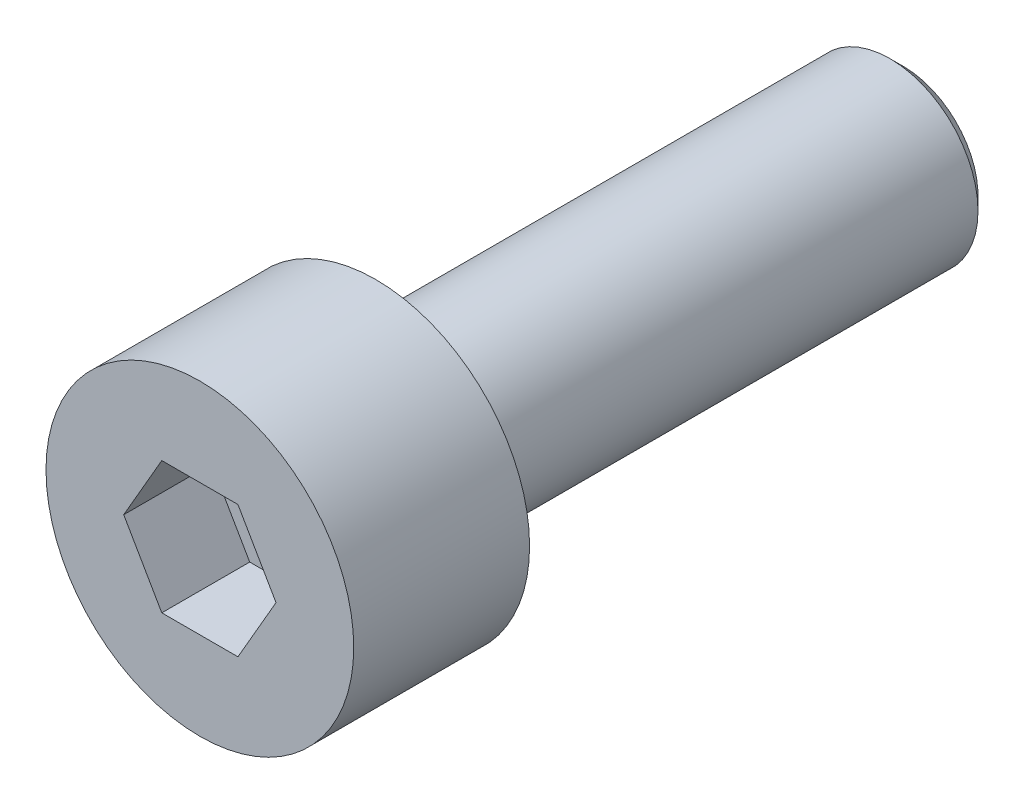
ISO-10303-21;
HEADER;
FILE_DESCRIPTION(('STEP AP214'),'2;1');
FILE_NAME('part.step','',(''),(''),'','','');
FILE_SCHEMA(('AUTOMOTIVE_DESIGN { 1 0 10303 214 1 1 1 1 }'));
ENDSEC;
DATA;
#1=APPLICATION_CONTEXT('core data for automotive mechanical design processes');
#2=APPLICATION_PROTOCOL_DEFINITION('international standard','automotive_design',2000,#1);
#3=PRODUCT_CONTEXT('',#1,'mechanical');
#4=PRODUCT('Part','Part','',(#3));
#5=PRODUCT_RELATED_PRODUCT_CATEGORY('part','',(#4));
#6=PRODUCT_DEFINITION_FORMATION('','',#4);
#7=PRODUCT_DEFINITION_CONTEXT('part definition',#1,'design');
#8=PRODUCT_DEFINITION('design','',#6,#7);
#9=PRODUCT_DEFINITION_SHAPE('','',#8);
#10=(LENGTH_UNIT() NAMED_UNIT(*) SI_UNIT(.MILLI.,.METRE.));
#11=(NAMED_UNIT(*) PLANE_ANGLE_UNIT() SI_UNIT($,.RADIAN.));
#12=(NAMED_UNIT(*) SI_UNIT($,.STERADIAN.) SOLID_ANGLE_UNIT());
#13=UNCERTAINTY_MEASURE_WITH_UNIT(LENGTH_MEASURE(1.E-05),#10,'distance_accuracy_value','');
#14=(GEOMETRIC_REPRESENTATION_CONTEXT(3) GLOBAL_UNCERTAINTY_ASSIGNED_CONTEXT((#13)) GLOBAL_UNIT_ASSIGNED_CONTEXT((#10,
#11,#12)) REPRESENTATION_CONTEXT('',''));
#15=CARTESIAN_POINT('',(0.,0.,0.));
#16=DIRECTION('',(0.,0.,1.));
#17=DIRECTION('',(1.,0.,0.));
#18=AXIS2_PLACEMENT_3D('',#15,#16,#17);
#19=CARTESIAN_POINT('',(0.,0.,0.));
#20=DIRECTION('',(0.,0.,1.));
#21=DIRECTION('',(1.,0.,0.));
#22=AXIS2_PLACEMENT_3D('',#19,#20,#21);
#23=PLANE('',#22);
#24=DIRECTION('',(0.5,0.866025403784439,0.));
#25=VECTOR('',#24,1.);
#26=CARTESIAN_POINT('',(0.86602540378444,-1.5,0.));
#27=LINE('',#26,#25);
#28=CARTESIAN_POINT('',(0.86602540378444,-1.5,0.));
#29=VERTEX_POINT('',#28);
#30=CARTESIAN_POINT('',(1.73205080756888,0.,0.));
#31=VERTEX_POINT('',#30);
#32=EDGE_CURVE('E50',#29,#31,#27,.T.);
#33=ORIENTED_EDGE('',*,*,#32,.F.);
#34=DIRECTION('',(1.,0.,0.));
#35=VECTOR('',#34,1.);
#36=CARTESIAN_POINT('',(-0.866025403784438,-1.5,0.));
#37=LINE('',#36,#35);
#38=CARTESIAN_POINT('',(-0.866025403784438,-1.5,0.));
#39=VERTEX_POINT('',#38);
#40=EDGE_CURVE('E133',#39,#29,#37,.T.);
#41=ORIENTED_EDGE('',*,*,#40,.F.);
#42=DIRECTION('',(0.5,-0.866025403784438,0.));
#43=VECTOR('',#42,1.);
#44=CARTESIAN_POINT('',(-1.73205080756888,0.,0.));
#45=LINE('',#44,#43);
#46=CARTESIAN_POINT('',(-1.73205080756888,0.,0.));
#47=VERTEX_POINT('',#46);
#48=EDGE_CURVE('E131',#47,#39,#45,.T.);
#49=ORIENTED_EDGE('',*,*,#48,.F.);
#50=DIRECTION('',(-0.5,-0.866025403784439,0.));
#51=VECTOR('',#50,1.);
#52=CARTESIAN_POINT('',(-0.866025403784438,1.5,0.));
#53=LINE('',#52,#51);
#54=CARTESIAN_POINT('',(-0.866025403784438,1.5,0.));
#55=VERTEX_POINT('',#54);
#56=EDGE_CURVE('E98',#55,#47,#53,.T.);
#57=ORIENTED_EDGE('',*,*,#56,.F.);
#58=DIRECTION('',(-1.,0.,0.));
#59=VECTOR('',#58,1.);
#60=CARTESIAN_POINT('',(0.866025403784438,1.5,0.));
#61=LINE('',#60,#59);
#62=CARTESIAN_POINT('',(0.866025403784438,1.5,0.));
#63=VERTEX_POINT('',#62);
#64=EDGE_CURVE('E127',#63,#55,#61,.T.);
#65=ORIENTED_EDGE('',*,*,#64,.F.);
#66=DIRECTION('',(-0.5,0.866025403784438,0.));
#67=VECTOR('',#66,1.);
#68=CARTESIAN_POINT('',(1.73205080756888,0.,0.));
#69=LINE('',#68,#67);
#70=EDGE_CURVE('E124',#31,#63,#69,.T.);
#71=ORIENTED_EDGE('',*,*,#70,.F.);
#72=EDGE_LOOP('',(#33,#41,#49,#57,#65,#71));
#73=FACE_BOUND('',#72,.T.);
#74=CARTESIAN_POINT('',(0.,0.,0.));
#75=DIRECTION('',(0.,0.,-1.));
#76=DIRECTION('',(-1.,0.,0.));
#77=AXIS2_PLACEMENT_3D('',#74,#75,#76);
#78=CIRCLE('',#77,3.5);
#79=CARTESIAN_POINT('',(-3.5,0.,0.));
#80=VERTEX_POINT('',#79);
#81=EDGE_CURVE('E145',#80,#80,#78,.T.);
#82=ORIENTED_EDGE('',*,*,#81,.F.);
#83=EDGE_LOOP('',(#82));
#84=FACE_BOUND('',#83,.T.);
#85=ADVANCED_FACE('F35',(#73,#84),#23,.T.);
#86=CARTESIAN_POINT('',(0.,0.,0.));
#87=DIRECTION('',(0.,0.,-1.));
#88=DIRECTION('',(-1.,0.,0.));
#89=AXIS2_PLACEMENT_3D('',#86,#87,#88);
#90=CYLINDRICAL_SURFACE('',#89,3.5);
#91=ORIENTED_EDGE('',*,*,#81,.T.);
#92=EDGE_LOOP('',(#91));
#93=FACE_BOUND('',#92,.T.);
#94=CARTESIAN_POINT('',(0.,0.,-4.));
#95=DIRECTION('',(0.,0.,-1.));
#96=DIRECTION('',(-1.,0.,0.));
#97=AXIS2_PLACEMENT_3D('',#94,#95,#96);
#98=CIRCLE('',#97,3.5);
#99=CARTESIAN_POINT('',(-3.5,0.,-4.));
#100=VERTEX_POINT('',#99);
#101=EDGE_CURVE('E137',#100,#100,#98,.T.);
#102=ORIENTED_EDGE('',*,*,#101,.F.);
#103=EDGE_LOOP('',(#102));
#104=FACE_BOUND('',#103,.T.);
#105=ADVANCED_FACE('F167',(#93,#104),#90,.T.);
#106=CARTESIAN_POINT('',(0.,3.5,-4.));
#107=DIRECTION('',(0.,0.,-1.));
#108=DIRECTION('',(-1.,0.,0.));
#109=AXIS2_PLACEMENT_3D('',#106,#107,#108);
#110=PLANE('',#109);
#111=CARTESIAN_POINT('',(0.,0.,-4.));
#112=DIRECTION('',(0.,0.,-1.));
#113=DIRECTION('',(-1.,0.,0.));
#114=AXIS2_PLACEMENT_3D('',#111,#112,#113);
#115=CIRCLE('',#114,2.3);
#116=CARTESIAN_POINT('',(-2.3,0.,-4.));
#117=VERTEX_POINT('',#116);
#118=EDGE_CURVE('E151',#117,#117,#115,.F.);
#119=ORIENTED_EDGE('',*,*,#118,.T.);
#120=EDGE_LOOP('',(#119));
#121=FACE_BOUND('',#120,.T.);
#122=ORIENTED_EDGE('',*,*,#101,.T.);
#123=EDGE_LOOP('',(#122));
#124=FACE_BOUND('',#123,.T.);
#125=ADVANCED_FACE('F173',(#121,#124),#110,.T.);
#126=CARTESIAN_POINT('',(0.,0.,0.));
#127=DIRECTION('',(0.,0.,-1.));
#128=DIRECTION('',(-1.,0.,0.));
#129=AXIS2_PLACEMENT_3D('',#126,#127,#128);
#130=CYLINDRICAL_SURFACE('',#129,2.);
#131=CARTESIAN_POINT('',(0.,0.,-15.7));
#132=DIRECTION('',(0.,0.,-1.));
#133=DIRECTION('',(-1.,0.,0.));
#134=AXIS2_PLACEMENT_3D('',#131,#132,#133);
#135=CIRCLE('',#134,2.);
#136=CARTESIAN_POINT('',(-2.,0.,-15.7));
#137=VERTEX_POINT('',#136);
#138=EDGE_CURVE('E11',#137,#137,#135,.F.);
#139=ORIENTED_EDGE('',*,*,#138,.T.);
#140=EDGE_LOOP('',(#139));
#141=FACE_BOUND('',#140,.T.);
#142=CARTESIAN_POINT('',(0.,0.,-4.3));
#143=DIRECTION('',(0.,0.,-1.));
#144=DIRECTION('',(-1.,0.,0.));
#145=AXIS2_PLACEMENT_3D('',#142,#143,#144);
#146=CIRCLE('',#145,2.);
#147=CARTESIAN_POINT('',(-2.,0.,-4.3));
#148=VERTEX_POINT('',#147);
#149=EDGE_CURVE('E148',#148,#148,#146,.T.);
#150=ORIENTED_EDGE('',*,*,#149,.T.);
#151=EDGE_LOOP('',(#150));
#152=FACE_BOUND('',#151,.T.);
#153=ADVANCED_FACE('F180',(#141,#152),#130,.T.);
#154=CARTESIAN_POINT('',(0.,2.,-16.));
#155=DIRECTION('',(0.,0.,-1.));
#156=DIRECTION('',(-1.,0.,0.));
#157=AXIS2_PLACEMENT_3D('',#154,#155,#156);
#158=PLANE('',#157);
#159=CARTESIAN_POINT('',(0.,0.,-16.));
#160=DIRECTION('',(0.,0.,-1.));
#161=DIRECTION('',(-1.,0.,0.));
#162=AXIS2_PLACEMENT_3D('',#159,#160,#161);
#163=CIRCLE('',#162,1.7);
#164=CARTESIAN_POINT('',(-1.7,0.,-16.));
#165=VERTEX_POINT('',#164);
#166=EDGE_CURVE('E43',#165,#165,#163,.T.);
#167=ORIENTED_EDGE('',*,*,#166,.T.);
#168=EDGE_LOOP('',(#167));
#169=FACE_BOUND('',#168,.T.);
#170=ADVANCED_FACE('F156',(#169),#158,.T.);
#171=CARTESIAN_POINT('',(0.86602540378444,-1.5,-2.));
#172=DIRECTION('',(0.866025403784439,-0.5,0.));
#173=DIRECTION('',(0.5,0.866025403784439,0.));
#174=AXIS2_PLACEMENT_3D('',#171,#172,#173);
#175=PLANE('',#174);
#176=ORIENTED_EDGE('',*,*,#32,.T.);
#177=DIRECTION('',(0.,0.,1.));
#178=VECTOR('',#177,1.);
#179=CARTESIAN_POINT('',(1.73205080756888,0.,-2.));
#180=LINE('',#179,#178);
#181=CARTESIAN_POINT('',(1.73205080756888,0.,-2.));
#182=VERTEX_POINT('',#181);
#183=EDGE_CURVE('E80',#182,#31,#180,.T.);
#184=ORIENTED_EDGE('',*,*,#183,.F.);
#185=DIRECTION('',(0.5,0.866025403784439,0.));
#186=VECTOR('',#185,1.);
#187=CARTESIAN_POINT('',(0.86602540378444,-1.5,-2.));
#188=LINE('',#187,#186);
#189=CARTESIAN_POINT('',(0.86602540378444,-1.5,-2.));
#190=VERTEX_POINT('',#189);
#191=EDGE_CURVE('E135',#190,#182,#188,.T.);
#192=ORIENTED_EDGE('',*,*,#191,.F.);
#193=DIRECTION('',(0.,0.,1.));
#194=VECTOR('',#193,1.);
#195=CARTESIAN_POINT('',(0.86602540378444,-1.5,-2.));
#196=LINE('',#195,#194);
#197=EDGE_CURVE('E58',#190,#29,#196,.T.);
#198=ORIENTED_EDGE('',*,*,#197,.T.);
#199=EDGE_LOOP('',(#176,#184,#192,#198));
#200=FACE_BOUND('',#199,.T.);
#201=ADVANCED_FACE('F187',(#200),#175,.F.);
#202=CARTESIAN_POINT('',(-0.866025403784438,-1.5,-2.));
#203=DIRECTION('',(0.,-1.,0.));
#204=DIRECTION('',(1.,0.,0.));
#205=AXIS2_PLACEMENT_3D('',#202,#203,#204);
#206=PLANE('',#205);
#207=ORIENTED_EDGE('',*,*,#40,.T.);
#208=ORIENTED_EDGE('',*,*,#197,.F.);
#209=DIRECTION('',(1.,0.,0.));
#210=VECTOR('',#209,1.);
#211=CARTESIAN_POINT('',(-0.866025403784438,-1.5,-2.));
#212=LINE('',#211,#210);
#213=CARTESIAN_POINT('',(-0.866025403784438,-1.5,-2.));
#214=VERTEX_POINT('',#213);
#215=EDGE_CURVE('E110',#214,#190,#212,.T.);
#216=ORIENTED_EDGE('',*,*,#215,.F.);
#217=DIRECTION('',(0.,0.,1.));
#218=VECTOR('',#217,1.);
#219=CARTESIAN_POINT('',(-0.866025403784438,-1.5,-2.));
#220=LINE('',#219,#218);
#221=EDGE_CURVE('E102',#214,#39,#220,.T.);
#222=ORIENTED_EDGE('',*,*,#221,.T.);
#223=EDGE_LOOP('',(#207,#208,#216,#222));
#224=FACE_BOUND('',#223,.T.);
#225=ADVANCED_FACE('F190',(#224),#206,.F.);
#226=CARTESIAN_POINT('',(-1.73205080756888,0.,-2.));
#227=DIRECTION('',(-0.866025403784438,-0.5,0.));
#228=DIRECTION('',(0.5,-0.866025403784438,0.));
#229=AXIS2_PLACEMENT_3D('',#226,#227,#228);
#230=PLANE('',#229);
#231=ORIENTED_EDGE('',*,*,#48,.T.);
#232=ORIENTED_EDGE('',*,*,#221,.F.);
#233=DIRECTION('',(0.5,-0.866025403784438,0.));
#234=VECTOR('',#233,1.);
#235=CARTESIAN_POINT('',(-1.73205080756888,0.,-2.));
#236=LINE('',#235,#234);
#237=CARTESIAN_POINT('',(-1.73205080756888,0.,-2.));
#238=VERTEX_POINT('',#237);
#239=EDGE_CURVE('E106',#238,#214,#236,.T.);
#240=ORIENTED_EDGE('',*,*,#239,.F.);
#241=DIRECTION('',(0.,0.,1.));
#242=VECTOR('',#241,1.);
#243=CARTESIAN_POINT('',(-1.73205080756888,0.,-2.));
#244=LINE('',#243,#242);
#245=EDGE_CURVE('E91',#238,#47,#244,.T.);
#246=ORIENTED_EDGE('',*,*,#245,.T.);
#247=EDGE_LOOP('',(#231,#232,#240,#246));
#248=FACE_BOUND('',#247,.T.);
#249=ADVANCED_FACE('F107',(#248),#230,.F.);
#250=CARTESIAN_POINT('',(-0.866025403784438,1.5,-2.));
#251=DIRECTION('',(-0.866025403784439,0.5,0.));
#252=DIRECTION('',(-0.5,-0.866025403784439,0.));
#253=AXIS2_PLACEMENT_3D('',#250,#251,#252);
#254=PLANE('',#253);
#255=ORIENTED_EDGE('',*,*,#56,.T.);
#256=ORIENTED_EDGE('',*,*,#245,.F.);
#257=DIRECTION('',(-0.5,-0.866025403784439,0.));
#258=VECTOR('',#257,1.);
#259=CARTESIAN_POINT('',(-0.866025403784438,1.5,-2.));
#260=LINE('',#259,#258);
#261=CARTESIAN_POINT('',(-0.866025403784438,1.5,-2.));
#262=VERTEX_POINT('',#261);
#263=EDGE_CURVE('E95',#262,#238,#260,.T.);
#264=ORIENTED_EDGE('',*,*,#263,.F.);
#265=DIRECTION('',(0.,0.,1.));
#266=VECTOR('',#265,1.);
#267=CARTESIAN_POINT('',(-0.866025403784438,1.5,-2.));
#268=LINE('',#267,#266);
#269=EDGE_CURVE('E103',#262,#55,#268,.T.);
#270=ORIENTED_EDGE('',*,*,#269,.T.);
#271=EDGE_LOOP('',(#255,#256,#264,#270));
#272=FACE_BOUND('',#271,.T.);
#273=ADVANCED_FACE('F93',(#272),#254,.F.);
#274=CARTESIAN_POINT('',(0.866025403784438,1.5,-2.));
#275=DIRECTION('',(0.,1.,0.));
#276=DIRECTION('',(0.,0.,1.));
#277=AXIS2_PLACEMENT_3D('',#274,#275,#276);
#278=PLANE('',#277);
#279=ORIENTED_EDGE('',*,*,#64,.T.);
#280=ORIENTED_EDGE('',*,*,#269,.F.);
#281=DIRECTION('',(-1.,0.,0.));
#282=VECTOR('',#281,1.);
#283=CARTESIAN_POINT('',(0.866025403784438,1.5,-2.));
#284=LINE('',#283,#282);
#285=CARTESIAN_POINT('',(0.866025403784438,1.5,-2.));
#286=VERTEX_POINT('',#285);
#287=EDGE_CURVE('E116',#286,#262,#284,.T.);
#288=ORIENTED_EDGE('',*,*,#287,.F.);
#289=DIRECTION('',(0.,0.,1.));
#290=VECTOR('',#289,1.);
#291=CARTESIAN_POINT('',(0.866025403784438,1.5,-2.));
#292=LINE('',#291,#290);
#293=EDGE_CURVE('E140',#286,#63,#292,.T.);
#294=ORIENTED_EDGE('',*,*,#293,.T.);
#295=EDGE_LOOP('',(#279,#280,#288,#294));
#296=FACE_BOUND('',#295,.T.);
#297=ADVANCED_FACE('F194',(#296),#278,.F.);
#298=CARTESIAN_POINT('',(1.73205080756888,0.,-2.));
#299=DIRECTION('',(0.866025403784438,0.5,0.));
#300=DIRECTION('',(-0.5,0.866025403784438,0.));
#301=AXIS2_PLACEMENT_3D('',#298,#299,#300);
#302=PLANE('',#301);
#303=ORIENTED_EDGE('',*,*,#70,.T.);
#304=ORIENTED_EDGE('',*,*,#293,.F.);
#305=DIRECTION('',(-0.5,0.866025403784438,0.));
#306=VECTOR('',#305,1.);
#307=CARTESIAN_POINT('',(1.73205080756888,0.,-2.));
#308=LINE('',#307,#306);
#309=EDGE_CURVE('E118',#182,#286,#308,.T.);
#310=ORIENTED_EDGE('',*,*,#309,.F.);
#311=ORIENTED_EDGE('',*,*,#183,.T.);
#312=EDGE_LOOP('',(#303,#304,#310,#311));
#313=FACE_BOUND('',#312,.T.);
#314=ADVANCED_FACE('F191',(#313),#302,.F.);
#315=CARTESIAN_POINT('',(0.,0.,-2.));
#316=DIRECTION('',(0.,0.,1.));
#317=DIRECTION('',(1.,0.,0.));
#318=AXIS2_PLACEMENT_3D('',#315,#316,#317);
#319=PLANE('',#318);
#320=ORIENTED_EDGE('',*,*,#191,.T.);
#321=ORIENTED_EDGE('',*,*,#309,.T.);
#322=ORIENTED_EDGE('',*,*,#287,.T.);
#323=ORIENTED_EDGE('',*,*,#263,.T.);
#324=ORIENTED_EDGE('',*,*,#239,.T.);
#325=ORIENTED_EDGE('',*,*,#215,.T.);
#326=EDGE_LOOP('',(#320,#321,#322,#323,#324,#325));
#327=FACE_BOUND('',#326,.T.);
#328=ADVANCED_FACE('F113',(#327),#319,.T.);
#329=CARTESIAN_POINT('',(0.,0.,-4.3));
#330=DIRECTION('',(0.,0.,-1.));
#331=DIRECTION('',(-1.,0.,0.));
#332=AXIS2_PLACEMENT_3D('',#329,#330,#331);
#333=TOROIDAL_SURFACE('',#332,2.3,0.3);
#334=ORIENTED_EDGE('',*,*,#118,.F.);
#335=EDGE_LOOP('',(#334));
#336=FACE_BOUND('',#335,.T.);
#337=ORIENTED_EDGE('',*,*,#149,.F.);
#338=EDGE_LOOP('',(#337));
#339=FACE_BOUND('',#338,.T.);
#340=ADVANCED_FACE('F159',(#336,#339),#333,.F.);
#341=CARTESIAN_POINT('',(0.,0.,-16.));
#342=DIRECTION('',(0.,0.,1.));
#343=DIRECTION('',(1.,0.,0.));
#344=AXIS2_PLACEMENT_3D('',#341,#342,#343);
#345=CONICAL_SURFACE('',#344,1.7,0.785398163397443);
#346=ORIENTED_EDGE('',*,*,#138,.F.);
#347=EDGE_LOOP('',(#346));
#348=FACE_BOUND('',#347,.T.);
#349=ORIENTED_EDGE('',*,*,#166,.F.);
#350=EDGE_LOOP('',(#349));
#351=FACE_BOUND('',#350,.T.);
#352=ADVANCED_FACE('F37',(#348,#351),#345,.T.);
#353=CLOSED_SHELL('',(#85,#105,#125,#153,#170,#201,#225,#249,#273,#297,#314,#328,#340,#352));
#354=MANIFOLD_SOLID_BREP('B2',#353);
#355=ADVANCED_BREP_SHAPE_REPRESENTATION('',(#18,#354),#14);
#356=SHAPE_DEFINITION_REPRESENTATION(#9,#355);
ENDSEC;
END-ISO-10303-21;
